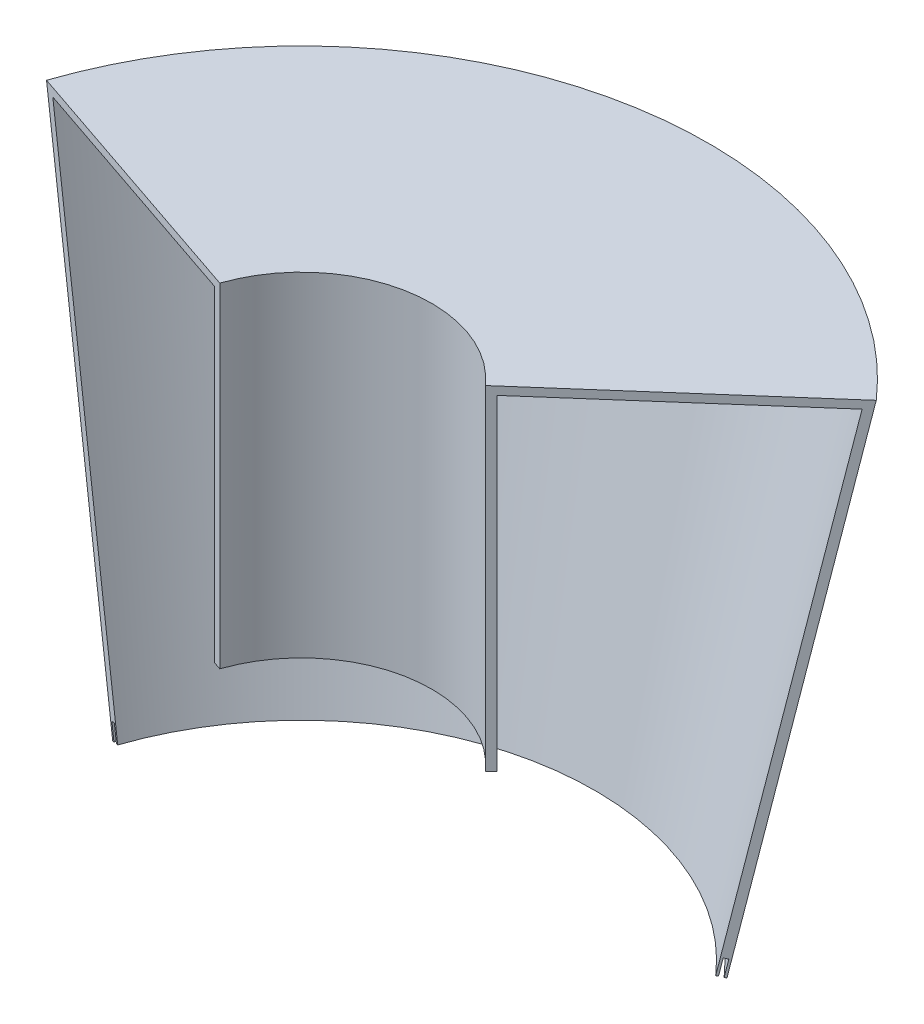
ISO-10303-21;
HEADER;
FILE_DESCRIPTION(('STEP AP214'),'2;1');
FILE_NAME('part.step','',(''),(''),'','','');
FILE_SCHEMA(('AUTOMOTIVE_DESIGN { 1 0 10303 214 1 1 1 1 }'));
ENDSEC;
DATA;
#1=APPLICATION_CONTEXT('core data for automotive mechanical design processes');
#2=APPLICATION_PROTOCOL_DEFINITION('international standard','automotive_design',2000,#1);
#3=PRODUCT_CONTEXT('',#1,'mechanical');
#4=PRODUCT('Part','Part','',(#3));
#5=PRODUCT_RELATED_PRODUCT_CATEGORY('part','',(#4));
#6=PRODUCT_DEFINITION_FORMATION('','',#4);
#7=PRODUCT_DEFINITION_CONTEXT('part definition',#1,'design');
#8=PRODUCT_DEFINITION('design','',#6,#7);
#9=PRODUCT_DEFINITION_SHAPE('','',#8);
#10=(LENGTH_UNIT() NAMED_UNIT(*) SI_UNIT(.MILLI.,.METRE.));
#11=(NAMED_UNIT(*) PLANE_ANGLE_UNIT() SI_UNIT($,.RADIAN.));
#12=(NAMED_UNIT(*) SI_UNIT($,.STERADIAN.) SOLID_ANGLE_UNIT());
#13=UNCERTAINTY_MEASURE_WITH_UNIT(LENGTH_MEASURE(1.E-05),#10,'distance_accuracy_value','');
#14=(GEOMETRIC_REPRESENTATION_CONTEXT(3) GLOBAL_UNCERTAINTY_ASSIGNED_CONTEXT((#13)) GLOBAL_UNIT_ASSIGNED_CONTEXT((#10,
#11,#12)) REPRESENTATION_CONTEXT('',''));
#15=CARTESIAN_POINT('',(0.,0.,0.));
#16=DIRECTION('',(0.,0.,1.));
#17=DIRECTION('',(1.,0.,0.));
#18=AXIS2_PLACEMENT_3D('',#15,#16,#17);
#19=CARTESIAN_POINT('',(0.,273.05,0.));
#20=DIRECTION('',(0.,-1.,0.));
#21=DIRECTION('',(0.,0.,-1.));
#22=AXIS2_PLACEMENT_3D('',#19,#20,#21);
#23=CONICAL_SURFACE('',#22,117.517905405405,1.36432189836906);
#24=DIRECTION('',(-0.735870560963402,0.205010493456675,0.645341161774188));
#25=VECTOR('',#24,1.);
#26=CARTESIAN_POINT('',(0.,297.665236943042,0.));
#27=LINE('',#26,#25);
#28=CARTESIAN_POINT('',(87.7705421175675,273.212727079181,-76.972699581222));
#29=VERTEX_POINT('',#28);
#30=CARTESIAN_POINT('',(88.3546393753322,273.05,-77.4849391283803));
#31=VERTEX_POINT('',#30);
#32=EDGE_CURVE('E11',#29,#31,#27,.F.);
#33=ORIENTED_EDGE('',*,*,#32,.F.);
#34=CARTESIAN_POINT('',(0.,273.212727079181,0.));
#35=DIRECTION('',(0.,-1.,0.));
#36=DIRECTION('',(0.,0.,-1.));
#37=AXIS2_PLACEMENT_3D('',#34,#35,#36);
#38=CIRCLE('',#37,116.741014833831);
#39=CARTESIAN_POINT('',(-110.54558429399,273.212727079181,-37.525169387134));
#40=VERTEX_POINT('',#39);
#41=EDGE_CURVE('E151',#40,#29,#38,.T.);
#42=ORIENTED_EDGE('',*,*,#41,.F.);
#43=DIRECTION('',(0.926817120685912,0.205010493456675,0.314612018804314));
#44=VECTOR('',#43,1.);
#45=CARTESIAN_POINT('',(0.,297.665236943042,0.));
#46=LINE('',#45,#44);
#47=CARTESIAN_POINT('',(-111.281245383534,273.05,-37.7748926770599));
#48=VERTEX_POINT('',#47);
#49=EDGE_CURVE('E48',#40,#48,#46,.F.);
#50=ORIENTED_EDGE('',*,*,#49,.T.);
#51=CARTESIAN_POINT('',(0.,273.05,0.));
#52=DIRECTION('',(0.,-1.,0.));
#53=DIRECTION('',(0.,0.,-1.));
#54=AXIS2_PLACEMENT_3D('',#51,#52,#53);
#55=CIRCLE('',#54,117.517905405405);
#56=EDGE_CURVE('E144',#48,#31,#55,.T.);
#57=ORIENTED_EDGE('',*,*,#56,.T.);
#58=EDGE_LOOP('',(#33,#42,#50,#57));
#59=FACE_BOUND('',#58,.T.);
#60=ADVANCED_FACE('F40',(#59),#23,.F.);
#61=CARTESIAN_POINT('',(0.,273.212727079181,0.));
#62=DIRECTION('',(0.,1.,0.));
#63=DIRECTION('',(0.,0.,1.));
#64=AXIS2_PLACEMENT_3D('',#61,#62,#63);
#65=CONICAL_SURFACE('',#64,116.741014833831,0.206474428425694);
#66=DIRECTION('',(0.154135049931531,0.978759775211828,-0.135172810912168));
#67=VECTOR('',#66,1.);
#68=CARTESIAN_POINT('',(0.,-284.131472772645,0.));
#69=LINE('',#68,#67);
#70=CARTESIAN_POINT('',(88.7492996846328,279.427851651776,-77.8310469305143));
#71=VERTEX_POINT('',#70);
#72=EDGE_CURVE('E65',#71,#29,#69,.F.);
#73=ORIENTED_EDGE('',*,*,#72,.F.);
#74=CARTESIAN_POINT('',(0.,279.427851651776,0.));
#75=DIRECTION('',(0.,-1.,0.));
#76=DIRECTION('',(0.,0.,-1.));
#77=AXIS2_PLACEMENT_3D('',#74,#75,#76);
#78=CIRCLE('',#77,118.04283146728);
#79=CARTESIAN_POINT('',(-111.778313687281,279.427851651776,-37.9436246297125));
#80=VERTEX_POINT('',#79);
#81=EDGE_CURVE('E155',#80,#71,#78,.T.);
#82=ORIENTED_EDGE('',*,*,#81,.F.);
#83=DIRECTION('',(-0.194130613116654,0.978759775211828,-0.0658984633982042));
#84=VECTOR('',#83,1.);
#85=CARTESIAN_POINT('',(0.,-284.131472772645,0.));
#86=LINE('',#85,#84);
#87=EDGE_CURVE('E239',#80,#40,#86,.F.);
#88=ORIENTED_EDGE('',*,*,#87,.T.);
#89=ORIENTED_EDGE('',*,*,#41,.T.);
#90=EDGE_LOOP('',(#73,#82,#88,#89));
#91=FACE_BOUND('',#90,.T.);
#92=ADVANCED_FACE('F283',(#91),#65,.F.);
#93=CARTESIAN_POINT('',(0.,279.427851651776,0.));
#94=DIRECTION('',(0.,-1.,0.));
#95=DIRECTION('',(0.,0.,-1.));
#96=AXIS2_PLACEMENT_3D('',#93,#94,#95);
#97=CONICAL_SURFACE('',#96,118.04283146728,1.3643218983693);
#98=DIRECTION('',(-0.73587056096344,0.205010493456439,0.64534116177422));
#99=VECTOR('',#98,1.);
#100=CARTESIAN_POINT('',(0.,304.153039323965,0.));
#101=LINE('',#100,#99);
#102=CARTESIAN_POINT('',(87.5811051691033,279.753305810138,-76.8065678361977));
#103=VERTEX_POINT('',#102);
#104=EDGE_CURVE('E204',#103,#71,#101,.F.);
#105=ORIENTED_EDGE('',*,*,#104,.F.);
#106=CARTESIAN_POINT('',(0.,279.753305810138,0.));
#107=DIRECTION('',(0.,-1.,0.));
#108=DIRECTION('',(0.,0.,-1.));
#109=AXIS2_PLACEMENT_3D('',#106,#107,#108);
#110=CIRCLE('',#109,116.489050324131);
#111=CARTESIAN_POINT('',(-110.306991508192,279.753305810138,-37.4441780498607));
#112=VERTEX_POINT('',#111);
#113=EDGE_CURVE('E161',#112,#103,#110,.T.);
#114=ORIENTED_EDGE('',*,*,#113,.F.);
#115=DIRECTION('',(0.926817120685959,0.205010493456439,0.31461201880433));
#116=VECTOR('',#115,1.);
#117=CARTESIAN_POINT('',(0.,304.153039323965,0.));
#118=LINE('',#117,#116);
#119=EDGE_CURVE('E235',#112,#80,#118,.F.);
#120=ORIENTED_EDGE('',*,*,#119,.T.);
#121=ORIENTED_EDGE('',*,*,#81,.T.);
#122=EDGE_LOOP('',(#105,#114,#120,#121));
#123=FACE_BOUND('',#122,.T.);
#124=ADVANCED_FACE('F280',(#123),#97,.F.);
#125=CARTESIAN_POINT('',(0.,279.753305810138,0.));
#126=DIRECTION('',(0.,1.,0.));
#127=DIRECTION('',(0.,0.,1.));
#128=AXIS2_PLACEMENT_3D('',#125,#126,#127);
#129=CONICAL_SURFACE('',#128,116.489050324131,0.206474428425686);
#130=DIRECTION('',(0.154135049931525,0.97875977521183,-0.135172810912163));
#131=VECTOR('',#130,1.);
#132=CARTESIAN_POINT('',(0.,-276.387966705079,0.));
#133=LINE('',#132,#131);
#134=CARTESIAN_POINT('',(86.6023476020381,273.538181237543,-75.9482204869055));
#135=VERTEX_POINT('',#134);
#136=EDGE_CURVE('E202',#135,#103,#133,.T.);
#137=ORIENTED_EDGE('',*,*,#136,.F.);
#138=CARTESIAN_POINT('',(0.,273.538181237543,0.));
#139=DIRECTION('',(0.,-1.,0.));
#140=DIRECTION('',(0.,0.,-1.));
#141=AXIS2_PLACEMENT_3D('',#138,#139,#140);
#142=CIRCLE('',#141,115.187233690682);
#143=CARTESIAN_POINT('',(-109.074262114901,273.538181237543,-37.0257228072821));
#144=VERTEX_POINT('',#143);
#145=EDGE_CURVE('E165',#144,#135,#142,.T.);
#146=ORIENTED_EDGE('',*,*,#145,.F.);
#147=DIRECTION('',(-0.194130613116646,0.97875977521183,-0.0658984633982016));
#148=VECTOR('',#147,1.);
#149=CARTESIAN_POINT('',(0.,-276.387966705079,0.));
#150=LINE('',#149,#148);
#151=EDGE_CURVE('E231',#144,#112,#150,.T.);
#152=ORIENTED_EDGE('',*,*,#151,.T.);
#153=ORIENTED_EDGE('',*,*,#113,.T.);
#154=EDGE_LOOP('',(#137,#146,#152,#153));
#155=FACE_BOUND('',#154,.T.);
#156=ADVANCED_FACE('F277',(#155),#129,.T.);
#157=CARTESIAN_POINT('',(0.,273.538181237543,0.));
#158=DIRECTION('',(0.,-1.,0.));
#159=DIRECTION('',(0.,0.,-1.));
#160=AXIS2_PLACEMENT_3D('',#157,#158,#159);
#161=CONICAL_SURFACE('',#160,115.187233690682,1.36432189836933);
#162=DIRECTION('',(-0.735870560963444,0.205010493456411,0.645341161774224));
#163=VECTOR('',#162,1.);
#164=CARTESIAN_POINT('',(0.,297.665236943009,0.));
#165=LINE('',#164,#163);
#166=CARTESIAN_POINT('',(86.0182503442734,273.700908316724,-75.4359809397473));
#167=VERTEX_POINT('',#166);
#168=EDGE_CURVE('E200',#167,#135,#165,.F.);
#169=ORIENTED_EDGE('',*,*,#168,.F.);
#170=CARTESIAN_POINT('',(0.,273.700908316725,0.));
#171=DIRECTION('',(0.,-1.,0.));
#172=DIRECTION('',(0.,0.,-1.));
#173=AXIS2_PLACEMENT_3D('',#170,#171,#172);
#174=CIRCLE('',#173,114.410343119108);
#175=CARTESIAN_POINT('',(-108.338601025357,273.700908316724,-36.7759995173562));
#176=VERTEX_POINT('',#175);
#177=EDGE_CURVE('E170',#176,#167,#174,.T.);
#178=ORIENTED_EDGE('',*,*,#177,.F.);
#179=DIRECTION('',(0.926817120685965,0.205010493456411,0.314612018804331));
#180=VECTOR('',#179,1.);
#181=CARTESIAN_POINT('',(0.,297.665236943009,0.));
#182=LINE('',#181,#180);
#183=EDGE_CURVE('E227',#176,#144,#182,.F.);
#184=ORIENTED_EDGE('',*,*,#183,.T.);
#185=ORIENTED_EDGE('',*,*,#145,.T.);
#186=EDGE_LOOP('',(#169,#178,#184,#185));
#187=FACE_BOUND('',#186,.T.);
#188=ADVANCED_FACE('F272',(#187),#161,.F.);
#189=CARTESIAN_POINT('',(0.,-3.175,0.));
#190=DIRECTION('',(0.,1.,0.));
#191=DIRECTION('',(0.,0.,1.));
#192=AXIS2_PLACEMENT_3D('',#189,#190,#191);
#193=CONICAL_SURFACE('',#192,56.4160650257399,0.20647442842569);
#194=DIRECTION('',(0.154135049931528,0.978759775211829,-0.135172810912165));
#195=VECTOR('',#194,1.);
#196=CARTESIAN_POINT('',(0.,-272.516213671274,0.));
#197=LINE('',#196,#195);
#198=CARTESIAN_POINT('',(116.415676518792,466.725,-102.09380823036));
#199=VERTEX_POINT('',#198);
#200=EDGE_CURVE('E198',#199,#167,#197,.F.);
#201=ORIENTED_EDGE('',*,*,#200,.F.);
#202=CARTESIAN_POINT('',(0.,466.725,0.));
#203=DIRECTION('',(0.,-1.,0.));
#204=DIRECTION('',(0.,0.,-1.));
#205=AXIS2_PLACEMENT_3D('',#202,#203,#204);
#206=CIRCLE('',#205,154.84106502574);
#207=CARTESIAN_POINT('',(-146.623669755984,466.725,-49.7720291488444));
#208=VERTEX_POINT('',#207);
#209=EDGE_CURVE('E175',#208,#199,#206,.T.);
#210=ORIENTED_EDGE('',*,*,#209,.F.);
#211=DIRECTION('',(-0.19413061311665,0.978759775211829,-0.0658984633982029));
#212=VECTOR('',#211,1.);
#213=CARTESIAN_POINT('',(0.,-272.516213671274,0.));
#214=LINE('',#213,#212);
#215=EDGE_CURVE('E223',#208,#176,#214,.F.);
#216=ORIENTED_EDGE('',*,*,#215,.T.);
#217=ORIENTED_EDGE('',*,*,#177,.T.);
#218=EDGE_LOOP('',(#201,#210,#216,#217));
#219=FACE_BOUND('',#218,.T.);
#220=ADVANCED_FACE('F269',(#219),#193,.F.);
#221=CARTESIAN_POINT('',(0.,339.725,0.));
#222=DIRECTION('',(0.,-1.,0.));
#223=DIRECTION('',(0.,0.,-1.));
#224=AXIS2_PLACEMENT_3D('',#221,#222,#223);
#225=PLANE('',#224);
#226=CARTESIAN_POINT('',(0.,339.725,0.));
#227=DIRECTION('',(0.,-1.,0.));
#228=DIRECTION('',(0.,0.,-1.));
#229=AXIS2_PLACEMENT_3D('',#226,#227,#228);
#230=CIRCLE('',#229,53.975);
#231=CARTESIAN_POINT('',(-51.1105537394985,339.725,-17.3496951397376));
#232=VERTEX_POINT('',#231);
#233=CARTESIAN_POINT('',(40.5805536086776,339.725,-35.5881903700264));
#234=VERTEX_POINT('',#233);
#235=EDGE_CURVE('E169',#232,#234,#230,.T.);
#236=ORIENTED_EDGE('',*,*,#235,.T.);
#237=DIRECTION('',(-0.751839807478974,0.,0.659345815100073));
#238=VECTOR('',#237,1.);
#239=CARTESIAN_POINT('',(0.,339.725,0.));
#240=LINE('',#239,#238);
#241=CARTESIAN_POINT('',(38.1934622199319,339.725,-33.4947674070837));
#242=VERTEX_POINT('',#241);
#243=EDGE_CURVE('E186',#234,#242,#240,.T.);
#244=ORIENTED_EDGE('',*,*,#243,.T.);
#245=CARTESIAN_POINT('',(0.,339.725,0.));
#246=DIRECTION('',(0.,-1.,0.));
#247=DIRECTION('',(0.,0.,-1.));
#248=AXIS2_PLACEMENT_3D('',#245,#246,#247);
#249=CIRCLE('',#248,50.8);
#250=CARTESIAN_POINT('',(-48.1040505783515,339.725,-16.3291248374001));
#251=VERTEX_POINT('',#250);
#252=EDGE_CURVE('E176',#242,#251,#249,.F.);
#253=ORIENTED_EDGE('',*,*,#252,.T.);
#254=DIRECTION('',(0.946930129495109,0.,0.321439465303152));
#255=VECTOR('',#254,1.);
#256=CARTESIAN_POINT('',(0.,339.725,0.));
#257=LINE('',#256,#255);
#258=EDGE_CURVE('E209',#232,#251,#257,.T.);
#259=ORIENTED_EDGE('',*,*,#258,.F.);
#260=EDGE_LOOP('',(#236,#244,#253,#259));
#261=FACE_BOUND('',#260,.T.);
#262=ADVANCED_FACE('F256',(#261),#225,.T.);
#263=CARTESIAN_POINT('',(0.,339.725,0.));
#264=DIRECTION('',(0.,1.,0.));
#265=DIRECTION('',(0.,0.,1.));
#266=AXIS2_PLACEMENT_3D('',#263,#264,#265);
#267=CYLINDRICAL_SURFACE('',#266,53.975);
#268=DIRECTION('',(0.,1.,0.));
#269=VECTOR('',#268,1.);
#270=CARTESIAN_POINT('',(40.5805536086776,339.725,-35.5881903700264));
#271=LINE('',#270,#269);
#272=CARTESIAN_POINT('',(40.5805536086776,466.725,-35.5881903700264));
#273=VERTEX_POINT('',#272);
#274=EDGE_CURVE('E147',#234,#273,#271,.T.);
#275=ORIENTED_EDGE('',*,*,#274,.F.);
#276=ORIENTED_EDGE('',*,*,#235,.F.);
#277=DIRECTION('',(0.,1.,0.));
#278=VECTOR('',#277,1.);
#279=CARTESIAN_POINT('',(-51.1105537394985,339.725,-17.3496951397376));
#280=LINE('',#279,#278);
#281=CARTESIAN_POINT('',(-51.1105537394985,466.725,-17.3496951397376));
#282=VERTEX_POINT('',#281);
#283=EDGE_CURVE('E214',#232,#282,#280,.T.);
#284=ORIENTED_EDGE('',*,*,#283,.T.);
#285=CARTESIAN_POINT('',(0.,466.725,0.));
#286=DIRECTION('',(0.,1.,0.));
#287=DIRECTION('',(0.,0.,1.));
#288=AXIS2_PLACEMENT_3D('',#285,#286,#287);
#289=CIRCLE('',#288,53.975);
#290=EDGE_CURVE('E179',#282,#273,#289,.F.);
#291=ORIENTED_EDGE('',*,*,#290,.T.);
#292=EDGE_LOOP('',(#275,#276,#284,#291));
#293=FACE_BOUND('',#292,.T.);
#294=ADVANCED_FACE('F261',(#293),#267,.T.);
#295=CARTESIAN_POINT('',(0.,0.,0.));
#296=DIRECTION('',(0.,-1.,0.));
#297=DIRECTION('',(0.,0.,-1.));
#298=AXIS2_PLACEMENT_3D('',#295,#296,#297);
#299=CYLINDRICAL_SURFACE('',#298,50.8);
#300=ORIENTED_EDGE('',*,*,#252,.F.);
#301=DIRECTION('',(0.,1.,0.));
#302=VECTOR('',#301,1.);
#303=CARTESIAN_POINT('',(38.1934622199319,273.05,-33.4947674070837));
#304=LINE('',#303,#302);
#305=CARTESIAN_POINT('',(38.1934622199319,469.9,-33.4947674070837));
#306=VERTEX_POINT('',#305);
#307=EDGE_CURVE('E243',#242,#306,#304,.T.);
#308=ORIENTED_EDGE('',*,*,#307,.T.);
#309=CARTESIAN_POINT('',(0.,469.9,0.));
#310=DIRECTION('',(0.,-1.,0.));
#311=DIRECTION('',(0.,0.,-1.));
#312=AXIS2_PLACEMENT_3D('',#309,#310,#311);
#313=CIRCLE('',#312,50.8);
#314=CARTESIAN_POINT('',(-48.1040505783515,469.9,-16.3291248374001));
#315=VERTEX_POINT('',#314);
#316=EDGE_CURVE('E174',#315,#306,#313,.T.);
#317=ORIENTED_EDGE('',*,*,#316,.F.);
#318=DIRECTION('',(0.,-1.,0.));
#319=VECTOR('',#318,1.);
#320=CARTESIAN_POINT('',(-48.1040505783515,0.,-16.3291248374001));
#321=LINE('',#320,#319);
#322=EDGE_CURVE('E207',#251,#315,#321,.F.);
#323=ORIENTED_EDGE('',*,*,#322,.F.);
#324=EDGE_LOOP('',(#300,#308,#317,#323));
#325=FACE_BOUND('',#324,.T.);
#326=ADVANCED_FACE('F248',(#325),#299,.F.);
#327=CARTESIAN_POINT('',(-158.75,469.9,0.));
#328=DIRECTION('',(0.,1.,0.));
#329=DIRECTION('',(0.,0.,1.));
#330=AXIS2_PLACEMENT_3D('',#327,#328,#329);
#331=PLANE('',#330);
#332=ORIENTED_EDGE('',*,*,#316,.T.);
#333=DIRECTION('',(0.751839807478974,0.,-0.659345815100073));
#334=VECTOR('',#333,1.);
#335=CARTESIAN_POINT('',(-89.7355165074657,469.9,78.6959358715463));
#336=LINE('',#335,#334);
#337=CARTESIAN_POINT('',(119.354569437287,469.9,-104.671148147137));
#338=VERTEX_POINT('',#337);
#339=EDGE_CURVE('E194',#306,#338,#336,.T.);
#340=ORIENTED_EDGE('',*,*,#339,.T.);
#341=CARTESIAN_POINT('',(0.,469.9,0.));
#342=DIRECTION('',(0.,-1.,0.));
#343=DIRECTION('',(0.,0.,-1.));
#344=AXIS2_PLACEMENT_3D('',#341,#342,#343);
#345=CIRCLE('',#344,158.75);
#346=CARTESIAN_POINT('',(-150.325158057349,469.9,-51.0285151168753));
#347=VERTEX_POINT('',#346);
#348=EDGE_CURVE('E146',#347,#338,#345,.T.);
#349=ORIENTED_EDGE('',*,*,#348,.F.);
#350=DIRECTION('',(-0.946930129495109,0.,-0.321439465303152));
#351=VECTOR('',#350,1.);
#352=CARTESIAN_POINT('',(-142.347421385618,469.9,-48.3204384275659));
#353=LINE('',#352,#351);
#354=EDGE_CURVE('E211',#315,#347,#353,.T.);
#355=ORIENTED_EDGE('',*,*,#354,.F.);
#356=EDGE_LOOP('',(#332,#340,#349,#355));
#357=FACE_BOUND('',#356,.T.);
#358=ADVANCED_FACE('F252',(#357),#331,.T.);
#359=CARTESIAN_POINT('',(-158.75,466.725,0.));
#360=DIRECTION('',(0.,1.,0.));
#361=DIRECTION('',(0.,0.,1.));
#362=AXIS2_PLACEMENT_3D('',#359,#360,#361);
#363=PLANE('',#362);
#364=DIRECTION('',(0.751839807478974,0.,-0.659345815100073));
#365=VECTOR('',#364,1.);
#366=CARTESIAN_POINT('',(-89.7355165074657,466.725,78.6959358715463));
#367=LINE('',#366,#365);
#368=EDGE_CURVE('E148',#273,#199,#367,.T.);
#369=ORIENTED_EDGE('',*,*,#368,.F.);
#370=ORIENTED_EDGE('',*,*,#290,.F.);
#371=DIRECTION('',(-0.946930129495109,0.,-0.321439465303152));
#372=VECTOR('',#371,1.);
#373=CARTESIAN_POINT('',(-142.347421385618,466.725,-48.3204384275659));
#374=LINE('',#373,#372);
#375=EDGE_CURVE('E219',#282,#208,#374,.T.);
#376=ORIENTED_EDGE('',*,*,#375,.T.);
#377=ORIENTED_EDGE('',*,*,#209,.T.);
#378=EDGE_LOOP('',(#369,#370,#376,#377));
#379=FACE_BOUND('',#378,.T.);
#380=ADVANCED_FACE('F264',(#379),#363,.F.);
#381=CARTESIAN_POINT('',(0.,0.,0.));
#382=DIRECTION('',(0.,1.,0.));
#383=DIRECTION('',(0.,0.,1.));
#384=AXIS2_PLACEMENT_3D('',#381,#382,#383);
#385=CONICAL_SURFACE('',#384,60.325,0.20647442842569);
#386=ORIENTED_EDGE('',*,*,#348,.T.);
#387=DIRECTION('',(0.154135049931528,0.978759775211829,-0.135172810912165));
#388=VECTOR('',#387,1.);
#389=CARTESIAN_POINT('',(0.,-288.003225806452,0.));
#390=LINE('',#389,#388);
#391=EDGE_CURVE('E135',#338,#31,#390,.F.);
#392=ORIENTED_EDGE('',*,*,#391,.T.);
#393=ORIENTED_EDGE('',*,*,#56,.F.);
#394=DIRECTION('',(-0.19413061311665,0.978759775211829,-0.0658984633982029));
#395=VECTOR('',#394,1.);
#396=CARTESIAN_POINT('',(0.,-288.003225806452,0.));
#397=LINE('',#396,#395);
#398=EDGE_CURVE('E58',#347,#48,#397,.F.);
#399=ORIENTED_EDGE('',*,*,#398,.F.);
#400=EDGE_LOOP('',(#386,#392,#393,#399));
#401=FACE_BOUND('',#400,.T.);
#402=ADVANCED_FACE('F42',(#401),#385,.T.);
#403=CARTESIAN_POINT('',(0.,273.05,0.));
#404=DIRECTION('',(0.321439465303152,0.,-0.946930129495109));
#405=DIRECTION('',(-0.946930129495109,0.,-0.321439465303152));
#406=AXIS2_PLACEMENT_3D('',#403,#404,#405);
#407=PLANE('',#406);
#408=ORIENTED_EDGE('',*,*,#322,.T.);
#409=ORIENTED_EDGE('',*,*,#354,.T.);
#410=ORIENTED_EDGE('',*,*,#398,.T.);
#411=ORIENTED_EDGE('',*,*,#49,.F.);
#412=ORIENTED_EDGE('',*,*,#87,.F.);
#413=ORIENTED_EDGE('',*,*,#119,.F.);
#414=ORIENTED_EDGE('',*,*,#151,.F.);
#415=ORIENTED_EDGE('',*,*,#183,.F.);
#416=ORIENTED_EDGE('',*,*,#215,.F.);
#417=ORIENTED_EDGE('',*,*,#375,.F.);
#418=ORIENTED_EDGE('',*,*,#283,.F.);
#419=ORIENTED_EDGE('',*,*,#258,.T.);
#420=EDGE_LOOP('',(#408,#409,#410,#411,#412,#413,#414,#415,#416,#417,#418,#419));
#421=FACE_BOUND('',#420,.T.);
#422=ADVANCED_FACE('F253',(#421),#407,.F.);
#423=CARTESIAN_POINT('',(0.,273.05,0.));
#424=DIRECTION('',(0.659345815100073,0.,0.751839807478974));
#425=DIRECTION('',(0.751839807478974,0.,-0.659345815100073));
#426=AXIS2_PLACEMENT_3D('',#423,#424,#425);
#427=PLANE('',#426);
#428=ORIENTED_EDGE('',*,*,#274,.T.);
#429=ORIENTED_EDGE('',*,*,#368,.T.);
#430=ORIENTED_EDGE('',*,*,#200,.T.);
#431=ORIENTED_EDGE('',*,*,#168,.T.);
#432=ORIENTED_EDGE('',*,*,#136,.T.);
#433=ORIENTED_EDGE('',*,*,#104,.T.);
#434=ORIENTED_EDGE('',*,*,#72,.T.);
#435=ORIENTED_EDGE('',*,*,#32,.T.);
#436=ORIENTED_EDGE('',*,*,#391,.F.);
#437=ORIENTED_EDGE('',*,*,#339,.F.);
#438=ORIENTED_EDGE('',*,*,#307,.F.);
#439=ORIENTED_EDGE('',*,*,#243,.F.);
#440=EDGE_LOOP('',(#428,#429,#430,#431,#432,#433,#434,#435,#436,#437,#438,#439));
#441=FACE_BOUND('',#440,.T.);
#442=ADVANCED_FACE('F134',(#441),#427,.T.);
#443=CLOSED_SHELL('',(#60,#92,#124,#156,#188,#220,#262,#294,#326,#358,#380,#402,#422,#442));
#444=MANIFOLD_SOLID_BREP('B2',#443);
#445=ADVANCED_BREP_SHAPE_REPRESENTATION('',(#18,#444),#14);
#446=SHAPE_DEFINITION_REPRESENTATION(#9,#445);
ENDSEC;
END-ISO-10303-21;
